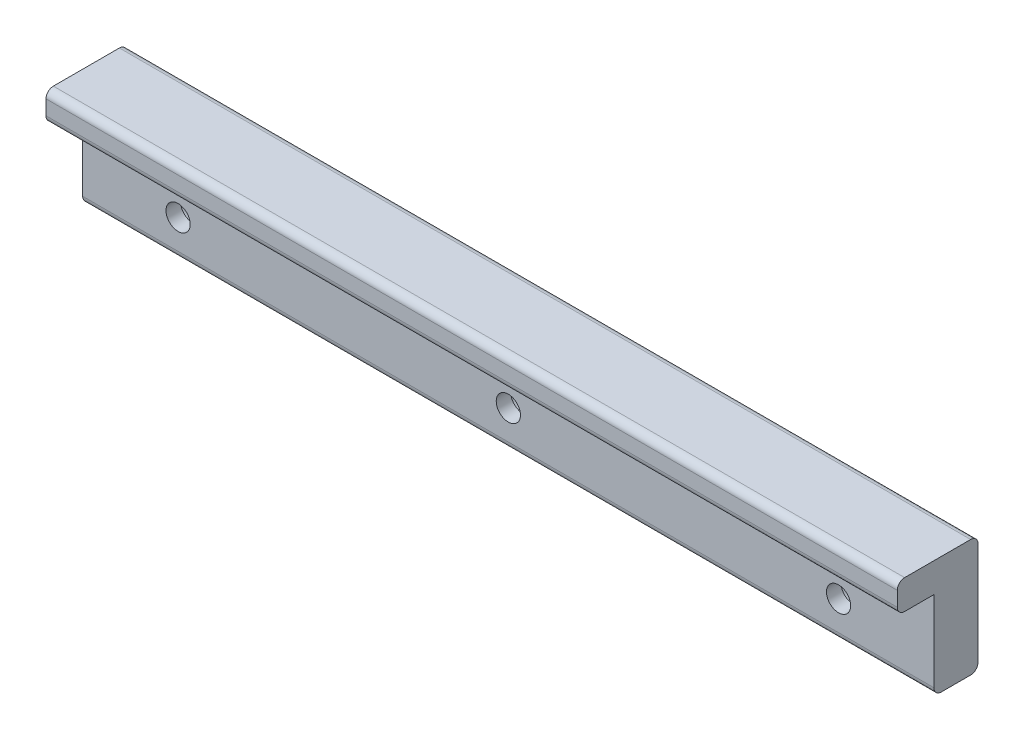
ISO-10303-21;
HEADER;
FILE_DESCRIPTION(('STEP AP214'),'2;1');
FILE_NAME('part.step','',(''),(''),'','','');
FILE_SCHEMA(('AUTOMOTIVE_DESIGN { 1 0 10303 214 1 1 1 1 }'));
ENDSEC;
DATA;
#1=APPLICATION_CONTEXT('core data for automotive mechanical design processes');
#2=APPLICATION_PROTOCOL_DEFINITION('international standard','automotive_design',2000,#1);
#3=PRODUCT_CONTEXT('',#1,'mechanical');
#4=PRODUCT('Part','Part','',(#3));
#5=PRODUCT_RELATED_PRODUCT_CATEGORY('part','',(#4));
#6=PRODUCT_DEFINITION_FORMATION('','',#4);
#7=PRODUCT_DEFINITION_CONTEXT('part definition',#1,'design');
#8=PRODUCT_DEFINITION('design','',#6,#7);
#9=PRODUCT_DEFINITION_SHAPE('','',#8);
#10=(LENGTH_UNIT() NAMED_UNIT(*) SI_UNIT(.MILLI.,.METRE.));
#11=(NAMED_UNIT(*) PLANE_ANGLE_UNIT() SI_UNIT($,.RADIAN.));
#12=(NAMED_UNIT(*) SI_UNIT($,.STERADIAN.) SOLID_ANGLE_UNIT());
#13=UNCERTAINTY_MEASURE_WITH_UNIT(LENGTH_MEASURE(1.E-05),#10,'distance_accuracy_value','');
#14=(GEOMETRIC_REPRESENTATION_CONTEXT(3) GLOBAL_UNCERTAINTY_ASSIGNED_CONTEXT((#13)) GLOBAL_UNIT_ASSIGNED_CONTEXT((#10,
#11,#12)) REPRESENTATION_CONTEXT('',''));
#15=CARTESIAN_POINT('',(0.,0.,0.));
#16=DIRECTION('',(0.,0.,1.));
#17=DIRECTION('',(1.,0.,0.));
#18=AXIS2_PLACEMENT_3D('',#15,#16,#17);
#19=CARTESIAN_POINT('',(58.,5.,5.001));
#20=DIRECTION('',(0.,0.,-1.));
#21=DIRECTION('',(0.,1.,0.));
#22=AXIS2_PLACEMENT_3D('',#19,#20,#21);
#23=CYLINDRICAL_SURFACE('',#22,1.65);
#24=CARTESIAN_POINT('',(58.,5.,0.));
#25=DIRECTION('',(0.,0.,-1.));
#26=DIRECTION('',(-1.,0.,0.));
#27=AXIS2_PLACEMENT_3D('',#24,#25,#26);
#28=CIRCLE('',#27,1.65);
#29=CARTESIAN_POINT('',(56.35,5.,0.));
#30=VERTEX_POINT('',#29);
#31=EDGE_CURVE('E186',#30,#30,#28,.F.);
#32=ORIENTED_EDGE('',*,*,#31,.T.);
#33=EDGE_LOOP('',(#32));
#34=FACE_BOUND('',#33,.T.);
#35=CARTESIAN_POINT('',(58.,5.,-2.));
#36=DIRECTION('',(0.,0.,-1.));
#37=DIRECTION('',(0.,1.,0.));
#38=AXIS2_PLACEMENT_3D('',#35,#36,#37);
#39=CIRCLE('',#38,1.65);
#40=CARTESIAN_POINT('',(58.,6.65,-2.));
#41=VERTEX_POINT('',#40);
#42=EDGE_CURVE('E182',#41,#41,#39,.F.);
#43=ORIENTED_EDGE('',*,*,#42,.F.);
#44=EDGE_LOOP('',(#43));
#45=FACE_BOUND('',#44,.T.);
#46=ADVANCED_FACE('F42',(#34,#45),#23,.F.);
#47=CARTESIAN_POINT('',(13.,5.,5.001));
#48=DIRECTION('',(0.,0.,-1.));
#49=DIRECTION('',(0.,1.,0.));
#50=AXIS2_PLACEMENT_3D('',#47,#48,#49);
#51=CYLINDRICAL_SURFACE('',#50,1.65);
#52=CARTESIAN_POINT('',(13.,5.,0.));
#53=DIRECTION('',(0.,0.,-1.));
#54=DIRECTION('',(-1.,0.,0.));
#55=AXIS2_PLACEMENT_3D('',#52,#53,#54);
#56=CIRCLE('',#55,1.65);
#57=CARTESIAN_POINT('',(11.35,5.,0.));
#58=VERTEX_POINT('',#57);
#59=EDGE_CURVE('E401',#58,#58,#56,.F.);
#60=ORIENTED_EDGE('',*,*,#59,.T.);
#61=EDGE_LOOP('',(#60));
#62=FACE_BOUND('',#61,.T.);
#63=CARTESIAN_POINT('',(13.,5.,-2.));
#64=DIRECTION('',(0.,0.,-1.));
#65=DIRECTION('',(0.,1.,0.));
#66=AXIS2_PLACEMENT_3D('',#63,#64,#65);
#67=CIRCLE('',#66,1.65);
#68=CARTESIAN_POINT('',(13.,6.65,-2.));
#69=VERTEX_POINT('',#68);
#70=EDGE_CURVE('E177',#69,#69,#67,.F.);
#71=ORIENTED_EDGE('',*,*,#70,.F.);
#72=EDGE_LOOP('',(#71));
#73=FACE_BOUND('',#72,.T.);
#74=ADVANCED_FACE('F295',(#62,#73),#51,.F.);
#75=CARTESIAN_POINT('',(103.,5.,5.001));
#76=DIRECTION('',(0.,0.,-1.));
#77=DIRECTION('',(0.,1.,0.));
#78=AXIS2_PLACEMENT_3D('',#75,#76,#77);
#79=CYLINDRICAL_SURFACE('',#78,1.65);
#80=CARTESIAN_POINT('',(103.,5.,0.));
#81=DIRECTION('',(0.,0.,-1.));
#82=DIRECTION('',(-1.,0.,0.));
#83=AXIS2_PLACEMENT_3D('',#80,#81,#82);
#84=CIRCLE('',#83,1.65);
#85=CARTESIAN_POINT('',(101.35,5.,0.));
#86=VERTEX_POINT('',#85);
#87=EDGE_CURVE('E155',#86,#86,#84,.F.);
#88=ORIENTED_EDGE('',*,*,#87,.T.);
#89=EDGE_LOOP('',(#88));
#90=FACE_BOUND('',#89,.T.);
#91=CARTESIAN_POINT('',(103.,5.,-2.));
#92=DIRECTION('',(0.,0.,-1.));
#93=DIRECTION('',(0.,1.,0.));
#94=AXIS2_PLACEMENT_3D('',#91,#92,#93);
#95=CIRCLE('',#94,1.65);
#96=CARTESIAN_POINT('',(103.,6.65,-2.));
#97=VERTEX_POINT('',#96);
#98=EDGE_CURVE('E173',#97,#97,#95,.F.);
#99=ORIENTED_EDGE('',*,*,#98,.F.);
#100=EDGE_LOOP('',(#99));
#101=FACE_BOUND('',#100,.T.);
#102=ADVANCED_FACE('F301',(#90,#101),#79,.F.);
#103=CARTESIAN_POINT('',(116.,0.,-6.));
#104=DIRECTION('',(0.,1.,0.));
#105=DIRECTION('',(0.,0.,1.));
#106=AXIS2_PLACEMENT_3D('',#103,#104,#105);
#107=PLANE('',#106);
#108=DIRECTION('',(0.,0.,-1.));
#109=VECTOR('',#108,1.);
#110=CARTESIAN_POINT('',(0.,0.,-6.));
#111=LINE('',#110,#109);
#112=CARTESIAN_POINT('',(0.,0.,-1.));
#113=VERTEX_POINT('',#112);
#114=CARTESIAN_POINT('',(0.,0.,-5.));
#115=VERTEX_POINT('',#114);
#116=EDGE_CURVE('E150',#113,#115,#111,.T.);
#117=ORIENTED_EDGE('',*,*,#116,.T.);
#118=DIRECTION('',(-1.,0.,0.));
#119=VECTOR('',#118,1.);
#120=CARTESIAN_POINT('',(116.,0.,-5.));
#121=LINE('',#120,#119);
#122=CARTESIAN_POINT('',(116.,0.,-5.));
#123=VERTEX_POINT('',#122);
#124=EDGE_CURVE('E212',#115,#123,#121,.F.);
#125=ORIENTED_EDGE('',*,*,#124,.T.);
#126=DIRECTION('',(0.,0.,-1.));
#127=VECTOR('',#126,1.);
#128=CARTESIAN_POINT('',(116.,0.,-6.));
#129=LINE('',#128,#127);
#130=CARTESIAN_POINT('',(116.,0.,-1.));
#131=VERTEX_POINT('',#130);
#132=EDGE_CURVE('E171',#131,#123,#129,.T.);
#133=ORIENTED_EDGE('',*,*,#132,.F.);
#134=DIRECTION('',(-1.,0.,0.));
#135=VECTOR('',#134,1.);
#136=CARTESIAN_POINT('',(116.,0.,-1.));
#137=LINE('',#136,#135);
#138=EDGE_CURVE('E208',#131,#113,#137,.T.);
#139=ORIENTED_EDGE('',*,*,#138,.T.);
#140=EDGE_LOOP('',(#117,#125,#133,#139));
#141=FACE_BOUND('',#140,.T.);
#142=ADVANCED_FACE('F254',(#141),#107,.F.);
#143=CARTESIAN_POINT('',(116.,16.,-6.));
#144=DIRECTION('',(0.,0.,1.));
#145=DIRECTION('',(0.,-1.,0.));
#146=AXIS2_PLACEMENT_3D('',#143,#144,#145);
#147=PLANE('',#146);
#148=CARTESIAN_POINT('',(103.,5.,-6.));
#149=DIRECTION('',(0.,0.,-1.));
#150=DIRECTION('',(0.,1.,0.));
#151=AXIS2_PLACEMENT_3D('',#148,#149,#150);
#152=CIRCLE('',#151,3.00000000000001);
#153=CARTESIAN_POINT('',(103.,8.00000000000001,-6.));
#154=VERTEX_POINT('',#153);
#155=EDGE_CURVE('E378',#154,#154,#152,.T.);
#156=ORIENTED_EDGE('',*,*,#155,.F.);
#157=EDGE_LOOP('',(#156));
#158=FACE_BOUND('',#157,.T.);
#159=CARTESIAN_POINT('',(58.,5.,-6.));
#160=DIRECTION('',(0.,0.,-1.));
#161=DIRECTION('',(0.,1.,0.));
#162=AXIS2_PLACEMENT_3D('',#159,#160,#161);
#163=CIRCLE('',#162,3.);
#164=CARTESIAN_POINT('',(58.,8.00000000000001,-6.));
#165=VERTEX_POINT('',#164);
#166=EDGE_CURVE('E382',#165,#165,#163,.T.);
#167=ORIENTED_EDGE('',*,*,#166,.F.);
#168=EDGE_LOOP('',(#167));
#169=FACE_BOUND('',#168,.T.);
#170=CARTESIAN_POINT('',(13.,5.,-6.));
#171=DIRECTION('',(0.,0.,-1.));
#172=DIRECTION('',(0.,1.,0.));
#173=AXIS2_PLACEMENT_3D('',#170,#171,#172);
#174=CIRCLE('',#173,3.);
#175=CARTESIAN_POINT('',(13.,8.,-6.));
#176=VERTEX_POINT('',#175);
#177=EDGE_CURVE('E392',#176,#176,#174,.T.);
#178=ORIENTED_EDGE('',*,*,#177,.F.);
#179=EDGE_LOOP('',(#178));
#180=FACE_BOUND('',#179,.T.);
#181=DIRECTION('',(0.,1.,0.));
#182=VECTOR('',#181,1.);
#183=CARTESIAN_POINT('',(116.,16.,-6.));
#184=LINE('',#183,#182);
#185=CARTESIAN_POINT('',(116.,1.,-6.));
#186=VERTEX_POINT('',#185);
#187=CARTESIAN_POINT('',(116.,15.,-6.));
#188=VERTEX_POINT('',#187);
#189=EDGE_CURVE('E257',#186,#188,#184,.T.);
#190=ORIENTED_EDGE('',*,*,#189,.F.);
#191=DIRECTION('',(-1.,0.,0.));
#192=VECTOR('',#191,1.);
#193=CARTESIAN_POINT('',(116.,1.,-6.));
#194=LINE('',#193,#192);
#195=CARTESIAN_POINT('',(0.,1.,-6.));
#196=VERTEX_POINT('',#195);
#197=EDGE_CURVE('E189',#186,#196,#194,.T.);
#198=ORIENTED_EDGE('',*,*,#197,.T.);
#199=DIRECTION('',(0.,1.,0.));
#200=VECTOR('',#199,1.);
#201=CARTESIAN_POINT('',(0.,16.,-6.));
#202=LINE('',#201,#200);
#203=CARTESIAN_POINT('',(0.,15.,-6.));
#204=VERTEX_POINT('',#203);
#205=EDGE_CURVE('E154',#196,#204,#202,.T.);
#206=ORIENTED_EDGE('',*,*,#205,.T.);
#207=DIRECTION('',(-1.,0.,0.));
#208=VECTOR('',#207,1.);
#209=CARTESIAN_POINT('',(116.,15.,-6.));
#210=LINE('',#209,#208);
#211=EDGE_CURVE('E143',#204,#188,#210,.F.);
#212=ORIENTED_EDGE('',*,*,#211,.T.);
#213=EDGE_LOOP('',(#190,#198,#206,#212));
#214=FACE_BOUND('',#213,.T.);
#215=ADVANCED_FACE('F322',(#158,#169,#180,#214),#147,.F.);
#216=CARTESIAN_POINT('',(116.,16.,5.));
#217=DIRECTION('',(0.,-1.,0.));
#218=DIRECTION('',(0.,0.,-1.));
#219=AXIS2_PLACEMENT_3D('',#216,#217,#218);
#220=PLANE('',#219);
#221=DIRECTION('',(0.,0.,1.));
#222=VECTOR('',#221,1.);
#223=CARTESIAN_POINT('',(116.,16.,5.));
#224=LINE('',#223,#222);
#225=CARTESIAN_POINT('',(116.,16.,-5.));
#226=VERTEX_POINT('',#225);
#227=CARTESIAN_POINT('',(116.,16.,4.));
#228=VERTEX_POINT('',#227);
#229=EDGE_CURVE('E261',#226,#228,#224,.T.);
#230=ORIENTED_EDGE('',*,*,#229,.F.);
#231=DIRECTION('',(-1.,0.,0.));
#232=VECTOR('',#231,1.);
#233=CARTESIAN_POINT('',(116.,16.,-5.));
#234=LINE('',#233,#232);
#235=CARTESIAN_POINT('',(0.,16.,-5.));
#236=VERTEX_POINT('',#235);
#237=EDGE_CURVE('E232',#226,#236,#234,.T.);
#238=ORIENTED_EDGE('',*,*,#237,.T.);
#239=DIRECTION('',(0.,0.,1.));
#240=VECTOR('',#239,1.);
#241=CARTESIAN_POINT('',(0.,16.,5.));
#242=LINE('',#241,#240);
#243=CARTESIAN_POINT('',(0.,16.,4.));
#244=VERTEX_POINT('',#243);
#245=EDGE_CURVE('E159',#236,#244,#242,.T.);
#246=ORIENTED_EDGE('',*,*,#245,.T.);
#247=DIRECTION('',(-1.,0.,0.));
#248=VECTOR('',#247,1.);
#249=CARTESIAN_POINT('',(116.,16.,4.));
#250=LINE('',#249,#248);
#251=EDGE_CURVE('E229',#244,#228,#250,.F.);
#252=ORIENTED_EDGE('',*,*,#251,.T.);
#253=EDGE_LOOP('',(#230,#238,#246,#252));
#254=FACE_BOUND('',#253,.T.);
#255=ADVANCED_FACE('F281',(#254),#220,.F.);
#256=CARTESIAN_POINT('',(116.,12.,5.));
#257=DIRECTION('',(0.,0.,-1.));
#258=DIRECTION('',(-1.,0.,0.));
#259=AXIS2_PLACEMENT_3D('',#256,#257,#258);
#260=PLANE('',#259);
#261=DIRECTION('',(0.,-1.,0.));
#262=VECTOR('',#261,1.);
#263=CARTESIAN_POINT('',(116.,12.,5.));
#264=LINE('',#263,#262);
#265=CARTESIAN_POINT('',(116.,15.,5.));
#266=VERTEX_POINT('',#265);
#267=CARTESIAN_POINT('',(116.,13.,5.));
#268=VERTEX_POINT('',#267);
#269=EDGE_CURVE('E134',#266,#268,#264,.T.);
#270=ORIENTED_EDGE('',*,*,#269,.F.);
#271=DIRECTION('',(-1.,0.,0.));
#272=VECTOR('',#271,1.);
#273=CARTESIAN_POINT('',(116.,15.,5.));
#274=LINE('',#273,#272);
#275=CARTESIAN_POINT('',(0.,15.,5.));
#276=VERTEX_POINT('',#275);
#277=EDGE_CURVE('E239',#266,#276,#274,.T.);
#278=ORIENTED_EDGE('',*,*,#277,.T.);
#279=DIRECTION('',(0.,-1.,0.));
#280=VECTOR('',#279,1.);
#281=CARTESIAN_POINT('',(0.,12.,5.));
#282=LINE('',#281,#280);
#283=CARTESIAN_POINT('',(0.,13.,5.));
#284=VERTEX_POINT('',#283);
#285=EDGE_CURVE('E163',#276,#284,#282,.T.);
#286=ORIENTED_EDGE('',*,*,#285,.T.);
#287=DIRECTION('',(-1.,0.,0.));
#288=VECTOR('',#287,1.);
#289=CARTESIAN_POINT('',(116.,13.,5.));
#290=LINE('',#289,#288);
#291=EDGE_CURVE('E236',#284,#268,#290,.F.);
#292=ORIENTED_EDGE('',*,*,#291,.T.);
#293=EDGE_LOOP('',(#270,#278,#286,#292));
#294=FACE_BOUND('',#293,.T.);
#295=ADVANCED_FACE('F275',(#294),#260,.F.);
#296=CARTESIAN_POINT('',(116.,12.,0.));
#297=DIRECTION('',(0.,1.,0.));
#298=DIRECTION('',(0.,0.,1.));
#299=AXIS2_PLACEMENT_3D('',#296,#297,#298);
#300=PLANE('',#299);
#301=DIRECTION('',(0.,0.,-1.));
#302=VECTOR('',#301,1.);
#303=CARTESIAN_POINT('',(116.,12.,0.));
#304=LINE('',#303,#302);
#305=CARTESIAN_POINT('',(116.,12.,4.));
#306=VERTEX_POINT('',#305);
#307=CARTESIAN_POINT('',(116.,12.,0.));
#308=VERTEX_POINT('',#307);
#309=EDGE_CURVE('E124',#306,#308,#304,.T.);
#310=ORIENTED_EDGE('',*,*,#309,.F.);
#311=DIRECTION('',(-1.,0.,0.));
#312=VECTOR('',#311,1.);
#313=CARTESIAN_POINT('',(116.,12.,4.));
#314=LINE('',#313,#312);
#315=CARTESIAN_POINT('',(0.,12.,4.));
#316=VERTEX_POINT('',#315);
#317=EDGE_CURVE('E51',#306,#316,#314,.T.);
#318=ORIENTED_EDGE('',*,*,#317,.T.);
#319=DIRECTION('',(0.,0.,-1.));
#320=VECTOR('',#319,1.);
#321=CARTESIAN_POINT('',(0.,12.,0.));
#322=LINE('',#321,#320);
#323=CARTESIAN_POINT('',(0.,12.,0.));
#324=VERTEX_POINT('',#323);
#325=EDGE_CURVE('E140',#316,#324,#322,.T.);
#326=ORIENTED_EDGE('',*,*,#325,.T.);
#327=DIRECTION('',(-1.,0.,0.));
#328=VECTOR('',#327,1.);
#329=CARTESIAN_POINT('',(116.,12.,0.));
#330=LINE('',#329,#328);
#331=EDGE_CURVE('E137',#308,#324,#330,.T.);
#332=ORIENTED_EDGE('',*,*,#331,.F.);
#333=EDGE_LOOP('',(#310,#318,#326,#332));
#334=FACE_BOUND('',#333,.T.);
#335=ADVANCED_FACE('F138',(#334),#300,.F.);
#336=CARTESIAN_POINT('',(116.,0.,0.));
#337=DIRECTION('',(0.,0.,-1.));
#338=DIRECTION('',(-1.,0.,0.));
#339=AXIS2_PLACEMENT_3D('',#336,#337,#338);
#340=PLANE('',#339);
#341=ORIENTED_EDGE('',*,*,#87,.F.);
#342=EDGE_LOOP('',(#341));
#343=FACE_BOUND('',#342,.T.);
#344=ORIENTED_EDGE('',*,*,#59,.F.);
#345=EDGE_LOOP('',(#344));
#346=FACE_BOUND('',#345,.T.);
#347=ORIENTED_EDGE('',*,*,#31,.F.);
#348=EDGE_LOOP('',(#347));
#349=FACE_BOUND('',#348,.T.);
#350=DIRECTION('',(0.,-1.,0.));
#351=VECTOR('',#350,1.);
#352=CARTESIAN_POINT('',(0.,0.,0.));
#353=LINE('',#352,#351);
#354=CARTESIAN_POINT('',(0.,1.,0.));
#355=VERTEX_POINT('',#354);
#356=EDGE_CURVE('E169',#324,#355,#353,.T.);
#357=ORIENTED_EDGE('',*,*,#356,.T.);
#358=DIRECTION('',(-1.,0.,0.));
#359=VECTOR('',#358,1.);
#360=CARTESIAN_POINT('',(116.,1.,0.));
#361=LINE('',#360,#359);
#362=CARTESIAN_POINT('',(116.,1.,0.));
#363=VERTEX_POINT('',#362);
#364=EDGE_CURVE('E11',#355,#363,#361,.F.);
#365=ORIENTED_EDGE('',*,*,#364,.T.);
#366=DIRECTION('',(0.,-1.,0.));
#367=VECTOR('',#366,1.);
#368=CARTESIAN_POINT('',(116.,0.,0.));
#369=LINE('',#368,#367);
#370=EDGE_CURVE('E128',#308,#363,#369,.T.);
#371=ORIENTED_EDGE('',*,*,#370,.F.);
#372=ORIENTED_EDGE('',*,*,#331,.T.);
#373=EDGE_LOOP('',(#357,#365,#371,#372));
#374=FACE_BOUND('',#373,.T.);
#375=ADVANCED_FACE('F145',(#343,#346,#349,#374),#340,.F.);
#376=CARTESIAN_POINT('',(116.,0.,0.));
#377=DIRECTION('',(-1.,0.,0.));
#378=DIRECTION('',(0.,0.,1.));
#379=AXIS2_PLACEMENT_3D('',#376,#377,#378);
#380=PLANE('',#379);
#381=ORIENTED_EDGE('',*,*,#132,.T.);
#382=CARTESIAN_POINT('',(116.,1.,-5.));
#383=DIRECTION('',(-1.,0.,0.));
#384=DIRECTION('',(0.,0.,1.));
#385=AXIS2_PLACEMENT_3D('',#382,#383,#384);
#386=CIRCLE('',#385,1.);
#387=EDGE_CURVE('E226',#123,#186,#386,.F.);
#388=ORIENTED_EDGE('',*,*,#387,.T.);
#389=ORIENTED_EDGE('',*,*,#189,.T.);
#390=CARTESIAN_POINT('',(116.,15.,-5.));
#391=DIRECTION('',(-1.,0.,0.));
#392=DIRECTION('',(0.,0.,1.));
#393=AXIS2_PLACEMENT_3D('',#390,#391,#392);
#394=CIRCLE('',#393,1.);
#395=EDGE_CURVE('E223',#188,#226,#394,.F.);
#396=ORIENTED_EDGE('',*,*,#395,.T.);
#397=ORIENTED_EDGE('',*,*,#229,.T.);
#398=CARTESIAN_POINT('',(116.,15.,4.));
#399=DIRECTION('',(-1.,0.,0.));
#400=DIRECTION('',(0.,0.,1.));
#401=AXIS2_PLACEMENT_3D('',#398,#399,#400);
#402=CIRCLE('',#401,1.);
#403=EDGE_CURVE('E220',#228,#266,#402,.F.);
#404=ORIENTED_EDGE('',*,*,#403,.T.);
#405=ORIENTED_EDGE('',*,*,#269,.T.);
#406=CARTESIAN_POINT('',(116.,13.,4.));
#407=DIRECTION('',(-1.,0.,0.));
#408=DIRECTION('',(0.,0.,1.));
#409=AXIS2_PLACEMENT_3D('',#406,#407,#408);
#410=CIRCLE('',#409,1.);
#411=EDGE_CURVE('E64',#268,#306,#410,.F.);
#412=ORIENTED_EDGE('',*,*,#411,.T.);
#413=ORIENTED_EDGE('',*,*,#309,.T.);
#414=ORIENTED_EDGE('',*,*,#370,.T.);
#415=CARTESIAN_POINT('',(116.,1.,-1.));
#416=DIRECTION('',(-1.,0.,0.));
#417=DIRECTION('',(0.,0.,1.));
#418=AXIS2_PLACEMENT_3D('',#415,#416,#417);
#419=CIRCLE('',#418,1.);
#420=EDGE_CURVE('E215',#363,#131,#419,.F.);
#421=ORIENTED_EDGE('',*,*,#420,.T.);
#422=EDGE_LOOP('',(#381,#388,#389,#396,#397,#404,#405,#412,#413,#414,#421));
#423=FACE_BOUND('',#422,.T.);
#424=ADVANCED_FACE('F127',(#423),#380,.F.);
#425=CARTESIAN_POINT('',(0.,0.,0.));
#426=DIRECTION('',(-1.,0.,0.));
#427=DIRECTION('',(0.,0.,1.));
#428=AXIS2_PLACEMENT_3D('',#425,#426,#427);
#429=PLANE('',#428);
#430=ORIENTED_EDGE('',*,*,#205,.F.);
#431=CARTESIAN_POINT('',(0.,1.,-5.));
#432=DIRECTION('',(-1.,0.,0.));
#433=DIRECTION('',(0.,0.,1.));
#434=AXIS2_PLACEMENT_3D('',#431,#432,#433);
#435=CIRCLE('',#434,1.);
#436=EDGE_CURVE('E205',#196,#115,#435,.T.);
#437=ORIENTED_EDGE('',*,*,#436,.T.);
#438=ORIENTED_EDGE('',*,*,#116,.F.);
#439=CARTESIAN_POINT('',(0.,1.,-1.));
#440=DIRECTION('',(-1.,0.,0.));
#441=DIRECTION('',(0.,0.,1.));
#442=AXIS2_PLACEMENT_3D('',#439,#440,#441);
#443=CIRCLE('',#442,1.);
#444=EDGE_CURVE('E193',#113,#355,#443,.T.);
#445=ORIENTED_EDGE('',*,*,#444,.T.);
#446=ORIENTED_EDGE('',*,*,#356,.F.);
#447=ORIENTED_EDGE('',*,*,#325,.F.);
#448=CARTESIAN_POINT('',(0.,13.,4.));
#449=DIRECTION('',(-1.,0.,0.));
#450=DIRECTION('',(0.,0.,1.));
#451=AXIS2_PLACEMENT_3D('',#448,#449,#450);
#452=CIRCLE('',#451,1.);
#453=EDGE_CURVE('E196',#316,#284,#452,.T.);
#454=ORIENTED_EDGE('',*,*,#453,.T.);
#455=ORIENTED_EDGE('',*,*,#285,.F.);
#456=CARTESIAN_POINT('',(0.,15.,4.));
#457=DIRECTION('',(-1.,0.,0.));
#458=DIRECTION('',(0.,0.,1.));
#459=AXIS2_PLACEMENT_3D('',#456,#457,#458);
#460=CIRCLE('',#459,1.);
#461=EDGE_CURVE('E199',#276,#244,#460,.T.);
#462=ORIENTED_EDGE('',*,*,#461,.T.);
#463=ORIENTED_EDGE('',*,*,#245,.F.);
#464=CARTESIAN_POINT('',(0.,15.,-5.));
#465=DIRECTION('',(-1.,0.,0.));
#466=DIRECTION('',(0.,0.,1.));
#467=AXIS2_PLACEMENT_3D('',#464,#465,#466);
#468=CIRCLE('',#467,1.);
#469=EDGE_CURVE('E202',#236,#204,#468,.T.);
#470=ORIENTED_EDGE('',*,*,#469,.T.);
#471=EDGE_LOOP('',(#430,#437,#438,#445,#446,#447,#454,#455,#462,#463,#470));
#472=FACE_BOUND('',#471,.T.);
#473=ADVANCED_FACE('F246',(#472),#429,.T.);
#474=CARTESIAN_POINT('',(103.,5.,-2.));
#475=DIRECTION('',(0.,0.,-1.));
#476=DIRECTION('',(0.,1.,0.));
#477=AXIS2_PLACEMENT_3D('',#474,#475,#476);
#478=PLANE('',#477);
#479=CARTESIAN_POINT('',(103.,5.,-2.));
#480=DIRECTION('',(0.,0.,-1.));
#481=DIRECTION('',(0.,1.,0.));
#482=AXIS2_PLACEMENT_3D('',#479,#480,#481);
#483=CIRCLE('',#482,3.00000000000001);
#484=CARTESIAN_POINT('',(103.,8.00000000000001,-2.));
#485=VERTEX_POINT('',#484);
#486=EDGE_CURVE('E178',#485,#485,#483,.T.);
#487=ORIENTED_EDGE('',*,*,#486,.T.);
#488=EDGE_LOOP('',(#487));
#489=FACE_BOUND('',#488,.T.);
#490=ORIENTED_EDGE('',*,*,#98,.T.);
#491=EDGE_LOOP('',(#490));
#492=FACE_BOUND('',#491,.T.);
#493=ADVANCED_FACE('F312',(#489,#492),#478,.T.);
#494=CARTESIAN_POINT('',(103.,5.,-2.));
#495=DIRECTION('',(0.,0.,-1.));
#496=DIRECTION('',(0.,1.,0.));
#497=AXIS2_PLACEMENT_3D('',#494,#495,#496);
#498=CYLINDRICAL_SURFACE('',#497,3.00000000000001);
#499=ORIENTED_EDGE('',*,*,#486,.F.);
#500=EDGE_LOOP('',(#499));
#501=FACE_BOUND('',#500,.T.);
#502=ORIENTED_EDGE('',*,*,#155,.T.);
#503=EDGE_LOOP('',(#502));
#504=FACE_BOUND('',#503,.T.);
#505=ADVANCED_FACE('F351',(#501,#504),#498,.F.);
#506=CARTESIAN_POINT('',(13.,5.,-2.));
#507=DIRECTION('',(0.,0.,-1.));
#508=DIRECTION('',(0.,1.,0.));
#509=AXIS2_PLACEMENT_3D('',#506,#507,#508);
#510=PLANE('',#509);
#511=CARTESIAN_POINT('',(13.,5.,-2.));
#512=DIRECTION('',(0.,0.,-1.));
#513=DIRECTION('',(0.,1.,0.));
#514=AXIS2_PLACEMENT_3D('',#511,#512,#513);
#515=CIRCLE('',#514,3.);
#516=CARTESIAN_POINT('',(13.,8.,-2.));
#517=VERTEX_POINT('',#516);
#518=EDGE_CURVE('E396',#517,#517,#515,.T.);
#519=ORIENTED_EDGE('',*,*,#518,.T.);
#520=EDGE_LOOP('',(#519));
#521=FACE_BOUND('',#520,.T.);
#522=ORIENTED_EDGE('',*,*,#70,.T.);
#523=EDGE_LOOP('',(#522));
#524=FACE_BOUND('',#523,.T.);
#525=ADVANCED_FACE('F356',(#521,#524),#510,.T.);
#526=CARTESIAN_POINT('',(13.,5.,-2.));
#527=DIRECTION('',(0.,0.,-1.));
#528=DIRECTION('',(0.,1.,0.));
#529=AXIS2_PLACEMENT_3D('',#526,#527,#528);
#530=CYLINDRICAL_SURFACE('',#529,3.);
#531=ORIENTED_EDGE('',*,*,#518,.F.);
#532=EDGE_LOOP('',(#531));
#533=FACE_BOUND('',#532,.T.);
#534=ORIENTED_EDGE('',*,*,#177,.T.);
#535=EDGE_LOOP('',(#534));
#536=FACE_BOUND('',#535,.T.);
#537=ADVANCED_FACE('F345',(#533,#536),#530,.F.);
#538=CARTESIAN_POINT('',(58.,5.,-2.));
#539=DIRECTION('',(0.,0.,-1.));
#540=DIRECTION('',(0.,1.,0.));
#541=AXIS2_PLACEMENT_3D('',#538,#539,#540);
#542=PLANE('',#541);
#543=CARTESIAN_POINT('',(58.,5.,-2.));
#544=DIRECTION('',(0.,0.,-1.));
#545=DIRECTION('',(0.,1.,0.));
#546=AXIS2_PLACEMENT_3D('',#543,#544,#545);
#547=CIRCLE('',#546,3.);
#548=CARTESIAN_POINT('',(58.,8.00000000000001,-2.));
#549=VERTEX_POINT('',#548);
#550=EDGE_CURVE('E388',#549,#549,#547,.T.);
#551=ORIENTED_EDGE('',*,*,#550,.T.);
#552=EDGE_LOOP('',(#551));
#553=FACE_BOUND('',#552,.T.);
#554=ORIENTED_EDGE('',*,*,#42,.T.);
#555=EDGE_LOOP('',(#554));
#556=FACE_BOUND('',#555,.T.);
#557=ADVANCED_FACE('F334',(#553,#556),#542,.T.);
#558=CARTESIAN_POINT('',(58.,5.,-2.));
#559=DIRECTION('',(0.,0.,-1.));
#560=DIRECTION('',(0.,1.,0.));
#561=AXIS2_PLACEMENT_3D('',#558,#559,#560);
#562=CYLINDRICAL_SURFACE('',#561,3.);
#563=ORIENTED_EDGE('',*,*,#550,.F.);
#564=EDGE_LOOP('',(#563));
#565=FACE_BOUND('',#564,.T.);
#566=ORIENTED_EDGE('',*,*,#166,.T.);
#567=EDGE_LOOP('',(#566));
#568=FACE_BOUND('',#567,.T.);
#569=ADVANCED_FACE('F329',(#565,#568),#562,.F.);
#570=CARTESIAN_POINT('',(116.,1.,-5.));
#571=DIRECTION('',(-1.,0.,0.));
#572=DIRECTION('',(0.,0.,1.));
#573=AXIS2_PLACEMENT_3D('',#570,#571,#572);
#574=CYLINDRICAL_SURFACE('',#573,1.);
#575=ORIENTED_EDGE('',*,*,#387,.F.);
#576=ORIENTED_EDGE('',*,*,#124,.F.);
#577=ORIENTED_EDGE('',*,*,#436,.F.);
#578=ORIENTED_EDGE('',*,*,#197,.F.);
#579=EDGE_LOOP('',(#575,#576,#577,#578));
#580=FACE_BOUND('',#579,.T.);
#581=ADVANCED_FACE('F291',(#580),#574,.T.);
#582=CARTESIAN_POINT('',(116.,15.,-5.));
#583=DIRECTION('',(-1.,0.,0.));
#584=DIRECTION('',(0.,0.,1.));
#585=AXIS2_PLACEMENT_3D('',#582,#583,#584);
#586=CYLINDRICAL_SURFACE('',#585,1.);
#587=ORIENTED_EDGE('',*,*,#395,.F.);
#588=ORIENTED_EDGE('',*,*,#211,.F.);
#589=ORIENTED_EDGE('',*,*,#469,.F.);
#590=ORIENTED_EDGE('',*,*,#237,.F.);
#591=EDGE_LOOP('',(#587,#588,#589,#590));
#592=FACE_BOUND('',#591,.T.);
#593=ADVANCED_FACE('F285',(#592),#586,.T.);
#594=CARTESIAN_POINT('',(116.,15.,4.));
#595=DIRECTION('',(-1.,0.,0.));
#596=DIRECTION('',(0.,0.,1.));
#597=AXIS2_PLACEMENT_3D('',#594,#595,#596);
#598=CYLINDRICAL_SURFACE('',#597,1.);
#599=ORIENTED_EDGE('',*,*,#403,.F.);
#600=ORIENTED_EDGE('',*,*,#251,.F.);
#601=ORIENTED_EDGE('',*,*,#461,.F.);
#602=ORIENTED_EDGE('',*,*,#277,.F.);
#603=EDGE_LOOP('',(#599,#600,#601,#602));
#604=FACE_BOUND('',#603,.T.);
#605=ADVANCED_FACE('F283',(#604),#598,.T.);
#606=CARTESIAN_POINT('',(116.,13.,4.));
#607=DIRECTION('',(-1.,0.,0.));
#608=DIRECTION('',(0.,0.,1.));
#609=AXIS2_PLACEMENT_3D('',#606,#607,#608);
#610=CYLINDRICAL_SURFACE('',#609,1.);
#611=ORIENTED_EDGE('',*,*,#411,.F.);
#612=ORIENTED_EDGE('',*,*,#291,.F.);
#613=ORIENTED_EDGE('',*,*,#453,.F.);
#614=ORIENTED_EDGE('',*,*,#317,.F.);
#615=EDGE_LOOP('',(#611,#612,#613,#614));
#616=FACE_BOUND('',#615,.T.);
#617=ADVANCED_FACE('F274',(#616),#610,.T.);
#618=CARTESIAN_POINT('',(116.,1.,-1.));
#619=DIRECTION('',(-1.,0.,0.));
#620=DIRECTION('',(0.,0.,1.));
#621=AXIS2_PLACEMENT_3D('',#618,#619,#620);
#622=CYLINDRICAL_SURFACE('',#621,1.);
#623=ORIENTED_EDGE('',*,*,#420,.F.);
#624=ORIENTED_EDGE('',*,*,#364,.F.);
#625=ORIENTED_EDGE('',*,*,#444,.F.);
#626=ORIENTED_EDGE('',*,*,#138,.F.);
#627=EDGE_LOOP('',(#623,#624,#625,#626));
#628=FACE_BOUND('',#627,.T.);
#629=ADVANCED_FACE('F44',(#628),#622,.T.);
#630=CLOSED_SHELL('',(#46,#74,#102,#142,#215,#255,#295,#335,#375,#424,#473,#493,#505,#525,#537,
#557,#569,#581,#593,#605,#617,#629));
#631=MANIFOLD_SOLID_BREP('B2',#630);
#632=ADVANCED_BREP_SHAPE_REPRESENTATION('',(#18,#631),#14);
#633=SHAPE_DEFINITION_REPRESENTATION(#9,#632);
ENDSEC;
END-ISO-10303-21;
